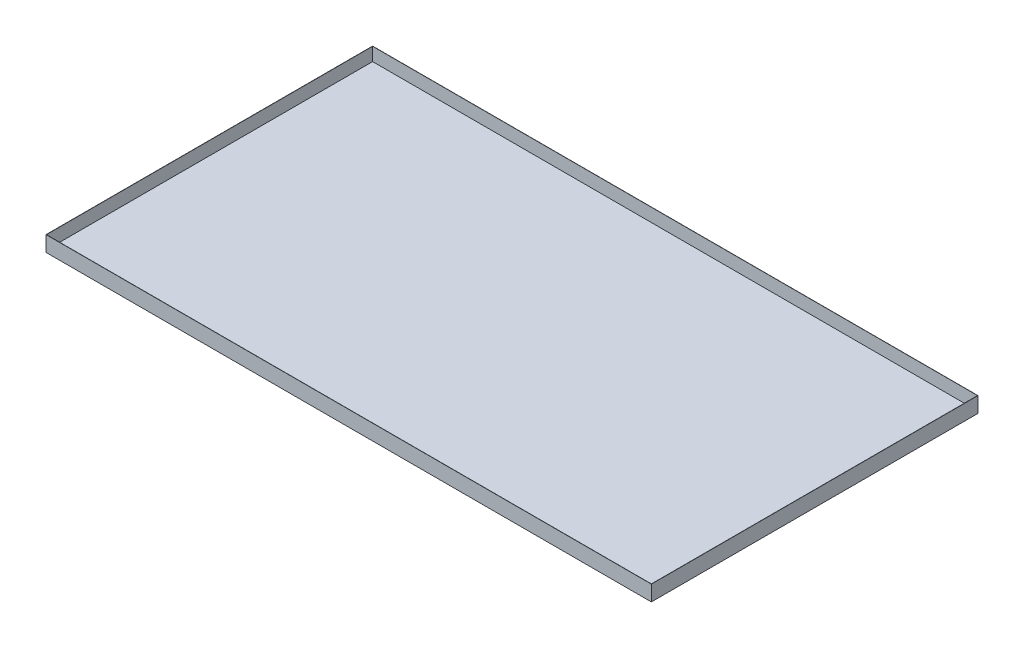
ISO-10303-21;
HEADER;
FILE_DESCRIPTION(('STEP AP214'),'2;1');
FILE_NAME('part.step','',(''),(''),'','','');
FILE_SCHEMA(('AUTOMOTIVE_DESIGN { 1 0 10303 214 1 1 1 1 }'));
ENDSEC;
DATA;
#1=APPLICATION_CONTEXT('core data for automotive mechanical design processes');
#2=APPLICATION_PROTOCOL_DEFINITION('international standard','automotive_design',2000,#1);
#3=PRODUCT_CONTEXT('',#1,'mechanical');
#4=PRODUCT('Part','Part','',(#3));
#5=PRODUCT_RELATED_PRODUCT_CATEGORY('part','',(#4));
#6=PRODUCT_DEFINITION_FORMATION('','',#4);
#7=PRODUCT_DEFINITION_CONTEXT('part definition',#1,'design');
#8=PRODUCT_DEFINITION('design','',#6,#7);
#9=PRODUCT_DEFINITION_SHAPE('','',#8);
#10=(LENGTH_UNIT() NAMED_UNIT(*) SI_UNIT(.MILLI.,.METRE.));
#11=(NAMED_UNIT(*) PLANE_ANGLE_UNIT() SI_UNIT($,.RADIAN.));
#12=(NAMED_UNIT(*) SI_UNIT($,.STERADIAN.) SOLID_ANGLE_UNIT());
#13=UNCERTAINTY_MEASURE_WITH_UNIT(LENGTH_MEASURE(1.E-05),#10,'distance_accuracy_value','');
#14=(GEOMETRIC_REPRESENTATION_CONTEXT(3) GLOBAL_UNCERTAINTY_ASSIGNED_CONTEXT((#13)) GLOBAL_UNIT_ASSIGNED_CONTEXT((#10,
#11,#12)) REPRESENTATION_CONTEXT('',''));
#15=CARTESIAN_POINT('',(0.,0.,0.));
#16=DIRECTION('',(0.,0.,1.));
#17=DIRECTION('',(1.,0.,0.));
#18=AXIS2_PLACEMENT_3D('',#15,#16,#17);
#19=CARTESIAN_POINT('',(0.,100.,0.));
#20=DIRECTION('',(0.,1.,0.));
#21=DIRECTION('',(0.,0.,1.));
#22=AXIS2_PLACEMENT_3D('',#19,#20,#21);
#23=PLANE('',#22);
#24=DIRECTION('',(0.,0.,-1.));
#25=VECTOR('',#24,1.);
#26=CARTESIAN_POINT('',(13910.,100.,-7500.));
#27=LINE('',#26,#25);
#28=CARTESIAN_POINT('',(13910.,100.,7500.));
#29=VERTEX_POINT('',#28);
#30=CARTESIAN_POINT('',(13910.,100.,-7500.));
#31=VERTEX_POINT('',#30);
#32=EDGE_CURVE('E159',#29,#31,#27,.T.);
#33=ORIENTED_EDGE('',*,*,#32,.T.);
#34=DIRECTION('',(-1.,0.,0.));
#35=VECTOR('',#34,1.);
#36=CARTESIAN_POINT('',(-13910.,100.,-7500.));
#37=LINE('',#36,#35);
#38=CARTESIAN_POINT('',(-13910.,100.,-7500.));
#39=VERTEX_POINT('',#38);
#40=EDGE_CURVE('E165',#31,#39,#37,.T.);
#41=ORIENTED_EDGE('',*,*,#40,.T.);
#42=DIRECTION('',(0.,0.,1.));
#43=VECTOR('',#42,1.);
#44=CARTESIAN_POINT('',(-13910.,100.,-7500.));
#45=LINE('',#44,#43);
#46=CARTESIAN_POINT('',(-13910.,100.,7500.));
#47=VERTEX_POINT('',#46);
#48=EDGE_CURVE('E45',#39,#47,#45,.T.);
#49=ORIENTED_EDGE('',*,*,#48,.T.);
#50=DIRECTION('',(1.,0.,0.));
#51=VECTOR('',#50,1.);
#52=CARTESIAN_POINT('',(-13910.,100.,7500.));
#53=LINE('',#52,#51);
#54=EDGE_CURVE('E11',#47,#29,#53,.T.);
#55=ORIENTED_EDGE('',*,*,#54,.T.);
#56=EDGE_LOOP('',(#33,#41,#49,#55));
#57=FACE_BOUND('',#56,.T.);
#58=ADVANCED_FACE('F37',(#57),#23,.T.);
#59=CARTESIAN_POINT('',(0.,0.,0.));
#60=DIRECTION('',(0.,1.,0.));
#61=DIRECTION('',(0.,0.,1.));
#62=AXIS2_PLACEMENT_3D('',#59,#60,#61);
#63=PLANE('',#62);
#64=DIRECTION('',(0.,0.,1.));
#65=VECTOR('',#64,1.);
#66=CARTESIAN_POINT('',(-13920.,0.,-7500.));
#67=LINE('',#66,#65);
#68=CARTESIAN_POINT('',(-13920.,0.,-7510.));
#69=VERTEX_POINT('',#68);
#70=CARTESIAN_POINT('',(-13920.,0.,7510.));
#71=VERTEX_POINT('',#70);
#72=EDGE_CURVE('E115',#69,#71,#67,.T.);
#73=ORIENTED_EDGE('',*,*,#72,.F.);
#74=DIRECTION('',(-1.,0.,0.));
#75=VECTOR('',#74,1.);
#76=CARTESIAN_POINT('',(13920.,0.,-7510.));
#77=LINE('',#76,#75);
#78=CARTESIAN_POINT('',(13920.,0.,-7510.));
#79=VERTEX_POINT('',#78);
#80=EDGE_CURVE('E114',#79,#69,#77,.T.);
#81=ORIENTED_EDGE('',*,*,#80,.F.);
#82=DIRECTION('',(0.,0.,-1.));
#83=VECTOR('',#82,1.);
#84=CARTESIAN_POINT('',(13920.,0.,7510.));
#85=LINE('',#84,#83);
#86=CARTESIAN_POINT('',(13920.,0.,7510.));
#87=VERTEX_POINT('',#86);
#88=EDGE_CURVE('E101',#87,#79,#85,.T.);
#89=ORIENTED_EDGE('',*,*,#88,.F.);
#90=DIRECTION('',(1.,0.,0.));
#91=VECTOR('',#90,1.);
#92=CARTESIAN_POINT('',(-13920.,0.,7510.));
#93=LINE('',#92,#91);
#94=EDGE_CURVE('E144',#71,#87,#93,.T.);
#95=ORIENTED_EDGE('',*,*,#94,.F.);
#96=EDGE_LOOP('',(#73,#81,#89,#95));
#97=FACE_BOUND('',#96,.T.);
#98=ADVANCED_FACE('F39',(#97),#63,.F.);
#99=CARTESIAN_POINT('',(-13910.,0.,0.));
#100=DIRECTION('',(1.,0.,0.));
#101=DIRECTION('',(0.,0.,-1.));
#102=AXIS2_PLACEMENT_3D('',#99,#100,#101);
#103=PLANE('',#102);
#104=ORIENTED_EDGE('',*,*,#48,.F.);
#105=DIRECTION('',(0.,-1.,0.));
#106=VECTOR('',#105,1.);
#107=CARTESIAN_POINT('',(-13910.,0.,-7500.));
#108=LINE('',#107,#106);
#109=CARTESIAN_POINT('',(-13910.,710.,-7500.));
#110=VERTEX_POINT('',#109);
#111=EDGE_CURVE('E150',#110,#39,#108,.T.);
#112=ORIENTED_EDGE('',*,*,#111,.F.);
#113=DIRECTION('',(0.,0.,-1.));
#114=VECTOR('',#113,1.);
#115=CARTESIAN_POINT('',(-13910.,710.,-7500.));
#116=LINE('',#115,#114);
#117=CARTESIAN_POINT('',(-13910.,710.,7500.));
#118=VERTEX_POINT('',#117);
#119=EDGE_CURVE('E157',#118,#110,#116,.T.);
#120=ORIENTED_EDGE('',*,*,#119,.F.);
#121=DIRECTION('',(0.,1.,0.));
#122=VECTOR('',#121,1.);
#123=CARTESIAN_POINT('',(-13910.,0.,7500.));
#124=LINE('',#123,#122);
#125=EDGE_CURVE('E58',#47,#118,#124,.T.);
#126=ORIENTED_EDGE('',*,*,#125,.F.);
#127=EDGE_LOOP('',(#104,#112,#120,#126));
#128=FACE_BOUND('',#127,.T.);
#129=ADVANCED_FACE('F178',(#128),#103,.T.);
#130=CARTESIAN_POINT('',(-13920.,710.,-7500.));
#131=DIRECTION('',(0.,-1.,0.));
#132=DIRECTION('',(0.,0.,-1.));
#133=AXIS2_PLACEMENT_3D('',#130,#131,#132);
#134=PLANE('',#133);
#135=ORIENTED_EDGE('',*,*,#119,.T.);
#136=DIRECTION('',(1.,0.,0.));
#137=VECTOR('',#136,1.);
#138=CARTESIAN_POINT('',(13920.,710.,-7500.));
#139=LINE('',#138,#137);
#140=CARTESIAN_POINT('',(13910.,710.,-7500.));
#141=VERTEX_POINT('',#140);
#142=EDGE_CURVE('E125',#110,#141,#139,.T.);
#143=ORIENTED_EDGE('',*,*,#142,.T.);
#144=DIRECTION('',(0.,0.,1.));
#145=VECTOR('',#144,1.);
#146=CARTESIAN_POINT('',(13910.,710.,7510.));
#147=LINE('',#146,#145);
#148=CARTESIAN_POINT('',(13910.,710.,7500.));
#149=VERTEX_POINT('',#148);
#150=EDGE_CURVE('E133',#141,#149,#147,.T.);
#151=ORIENTED_EDGE('',*,*,#150,.T.);
#152=DIRECTION('',(-1.,0.,0.));
#153=VECTOR('',#152,1.);
#154=CARTESIAN_POINT('',(-13920.,710.,7500.));
#155=LINE('',#154,#153);
#156=EDGE_CURVE('E145',#149,#118,#155,.T.);
#157=ORIENTED_EDGE('',*,*,#156,.T.);
#158=EDGE_LOOP('',(#135,#143,#151,#157));
#159=FACE_BOUND('',#158,.T.);
#160=DIRECTION('',(1.,0.,0.));
#161=VECTOR('',#160,1.);
#162=CARTESIAN_POINT('',(13920.,710.,-7510.));
#163=LINE('',#162,#161);
#164=CARTESIAN_POINT('',(-13920.,710.,-7510.));
#165=VERTEX_POINT('',#164);
#166=CARTESIAN_POINT('',(13920.,710.,-7510.));
#167=VERTEX_POINT('',#166);
#168=EDGE_CURVE('E124',#165,#167,#163,.T.);
#169=ORIENTED_EDGE('',*,*,#168,.F.);
#170=DIRECTION('',(0.,0.,-1.));
#171=VECTOR('',#170,1.);
#172=CARTESIAN_POINT('',(-13920.,710.,-7500.));
#173=LINE('',#172,#171);
#174=CARTESIAN_POINT('',(-13920.,710.,7510.));
#175=VERTEX_POINT('',#174);
#176=EDGE_CURVE('E156',#175,#165,#173,.T.);
#177=ORIENTED_EDGE('',*,*,#176,.F.);
#178=DIRECTION('',(-1.,0.,0.));
#179=VECTOR('',#178,1.);
#180=CARTESIAN_POINT('',(-13920.,710.,7510.));
#181=LINE('',#180,#179);
#182=CARTESIAN_POINT('',(13920.,710.,7510.));
#183=VERTEX_POINT('',#182);
#184=EDGE_CURVE('E147',#183,#175,#181,.T.);
#185=ORIENTED_EDGE('',*,*,#184,.F.);
#186=DIRECTION('',(0.,0.,1.));
#187=VECTOR('',#186,1.);
#188=CARTESIAN_POINT('',(13920.,710.,7510.));
#189=LINE('',#188,#187);
#190=EDGE_CURVE('E111',#167,#183,#189,.T.);
#191=ORIENTED_EDGE('',*,*,#190,.F.);
#192=EDGE_LOOP('',(#169,#177,#185,#191));
#193=FACE_BOUND('',#192,.T.);
#194=ADVANCED_FACE('F180',(#159,#193),#134,.F.);
#195=CARTESIAN_POINT('',(-13920.,0.,0.));
#196=DIRECTION('',(1.,0.,0.));
#197=DIRECTION('',(0.,0.,-1.));
#198=AXIS2_PLACEMENT_3D('',#195,#196,#197);
#199=PLANE('',#198);
#200=ORIENTED_EDGE('',*,*,#176,.T.);
#201=DIRECTION('',(0.,1.,0.));
#202=VECTOR('',#201,1.);
#203=CARTESIAN_POINT('',(-13920.,0.,-7510.));
#204=LINE('',#203,#202);
#205=EDGE_CURVE('E119',#69,#165,#204,.T.);
#206=ORIENTED_EDGE('',*,*,#205,.F.);
#207=ORIENTED_EDGE('',*,*,#72,.T.);
#208=DIRECTION('',(0.,-1.,0.));
#209=VECTOR('',#208,1.);
#210=CARTESIAN_POINT('',(-13920.,0.,7510.));
#211=LINE('',#210,#209);
#212=EDGE_CURVE('E141',#175,#71,#211,.T.);
#213=ORIENTED_EDGE('',*,*,#212,.F.);
#214=EDGE_LOOP('',(#200,#206,#207,#213));
#215=FACE_BOUND('',#214,.T.);
#216=ADVANCED_FACE('F183',(#215),#199,.F.);
#217=CARTESIAN_POINT('',(0.,0.,7500.));
#218=DIRECTION('',(0.,0.,-1.));
#219=DIRECTION('',(-1.,0.,0.));
#220=AXIS2_PLACEMENT_3D('',#217,#218,#219);
#221=PLANE('',#220);
#222=ORIENTED_EDGE('',*,*,#54,.F.);
#223=ORIENTED_EDGE('',*,*,#125,.T.);
#224=ORIENTED_EDGE('',*,*,#156,.F.);
#225=DIRECTION('',(0.,1.,0.));
#226=VECTOR('',#225,1.);
#227=CARTESIAN_POINT('',(13910.,0.,7500.));
#228=LINE('',#227,#226);
#229=EDGE_CURVE('E136',#29,#149,#228,.T.);
#230=ORIENTED_EDGE('',*,*,#229,.F.);
#231=EDGE_LOOP('',(#222,#223,#224,#230));
#232=FACE_BOUND('',#231,.T.);
#233=ADVANCED_FACE('F170',(#232),#221,.T.);
#234=CARTESIAN_POINT('',(0.,0.,7510.));
#235=DIRECTION('',(0.,0.,-1.));
#236=DIRECTION('',(-1.,0.,0.));
#237=AXIS2_PLACEMENT_3D('',#234,#235,#236);
#238=PLANE('',#237);
#239=ORIENTED_EDGE('',*,*,#212,.T.);
#240=ORIENTED_EDGE('',*,*,#94,.T.);
#241=DIRECTION('',(0.,-1.,0.));
#242=VECTOR('',#241,1.);
#243=CARTESIAN_POINT('',(13920.,0.,7510.));
#244=LINE('',#243,#242);
#245=EDGE_CURVE('E108',#183,#87,#244,.T.);
#246=ORIENTED_EDGE('',*,*,#245,.F.);
#247=ORIENTED_EDGE('',*,*,#184,.T.);
#248=EDGE_LOOP('',(#239,#240,#246,#247));
#249=FACE_BOUND('',#248,.T.);
#250=ADVANCED_FACE('F186',(#249),#238,.F.);
#251=CARTESIAN_POINT('',(13910.,0.,0.));
#252=DIRECTION('',(-1.,0.,0.));
#253=DIRECTION('',(0.,0.,1.));
#254=AXIS2_PLACEMENT_3D('',#251,#252,#253);
#255=PLANE('',#254);
#256=ORIENTED_EDGE('',*,*,#32,.F.);
#257=ORIENTED_EDGE('',*,*,#229,.T.);
#258=ORIENTED_EDGE('',*,*,#150,.F.);
#259=DIRECTION('',(0.,1.,0.));
#260=VECTOR('',#259,1.);
#261=CARTESIAN_POINT('',(13910.,0.,-7500.));
#262=LINE('',#261,#260);
#263=EDGE_CURVE('E131',#31,#141,#262,.T.);
#264=ORIENTED_EDGE('',*,*,#263,.F.);
#265=EDGE_LOOP('',(#256,#257,#258,#264));
#266=FACE_BOUND('',#265,.T.);
#267=ADVANCED_FACE('F174',(#266),#255,.T.);
#268=CARTESIAN_POINT('',(13920.,0.,0.));
#269=DIRECTION('',(-1.,0.,0.));
#270=DIRECTION('',(0.,0.,1.));
#271=AXIS2_PLACEMENT_3D('',#268,#269,#270);
#272=PLANE('',#271);
#273=ORIENTED_EDGE('',*,*,#245,.T.);
#274=ORIENTED_EDGE('',*,*,#88,.T.);
#275=DIRECTION('',(0.,-1.,0.));
#276=VECTOR('',#275,1.);
#277=CARTESIAN_POINT('',(13920.,0.,-7510.));
#278=LINE('',#277,#276);
#279=EDGE_CURVE('E106',#167,#79,#278,.T.);
#280=ORIENTED_EDGE('',*,*,#279,.F.);
#281=ORIENTED_EDGE('',*,*,#190,.T.);
#282=EDGE_LOOP('',(#273,#274,#280,#281));
#283=FACE_BOUND('',#282,.T.);
#284=ADVANCED_FACE('F103',(#283),#272,.F.);
#285=CARTESIAN_POINT('',(0.,0.,-7510.));
#286=DIRECTION('',(0.,0.,1.));
#287=DIRECTION('',(1.,0.,0.));
#288=AXIS2_PLACEMENT_3D('',#285,#286,#287);
#289=PLANE('',#288);
#290=ORIENTED_EDGE('',*,*,#279,.T.);
#291=ORIENTED_EDGE('',*,*,#80,.T.);
#292=ORIENTED_EDGE('',*,*,#205,.T.);
#293=ORIENTED_EDGE('',*,*,#168,.T.);
#294=EDGE_LOOP('',(#290,#291,#292,#293));
#295=FACE_BOUND('',#294,.T.);
#296=ADVANCED_FACE('F122',(#295),#289,.F.);
#297=CARTESIAN_POINT('',(0.,0.,-7500.));
#298=DIRECTION('',(0.,0.,1.));
#299=DIRECTION('',(1.,0.,0.));
#300=AXIS2_PLACEMENT_3D('',#297,#298,#299);
#301=PLANE('',#300);
#302=ORIENTED_EDGE('',*,*,#142,.F.);
#303=ORIENTED_EDGE('',*,*,#111,.T.);
#304=ORIENTED_EDGE('',*,*,#40,.F.);
#305=ORIENTED_EDGE('',*,*,#263,.T.);
#306=EDGE_LOOP('',(#302,#303,#304,#305));
#307=FACE_BOUND('',#306,.T.);
#308=ADVANCED_FACE('F177',(#307),#301,.T.);
#309=CLOSED_SHELL('',(#58,#98,#129,#194,#216,#233,#250,#267,#284,#296,#308));
#310=MANIFOLD_SOLID_BREP('B2',#309);
#311=ADVANCED_BREP_SHAPE_REPRESENTATION('',(#18,#310),#14);
#312=SHAPE_DEFINITION_REPRESENTATION(#9,#311);
ENDSEC;
END-ISO-10303-21;
